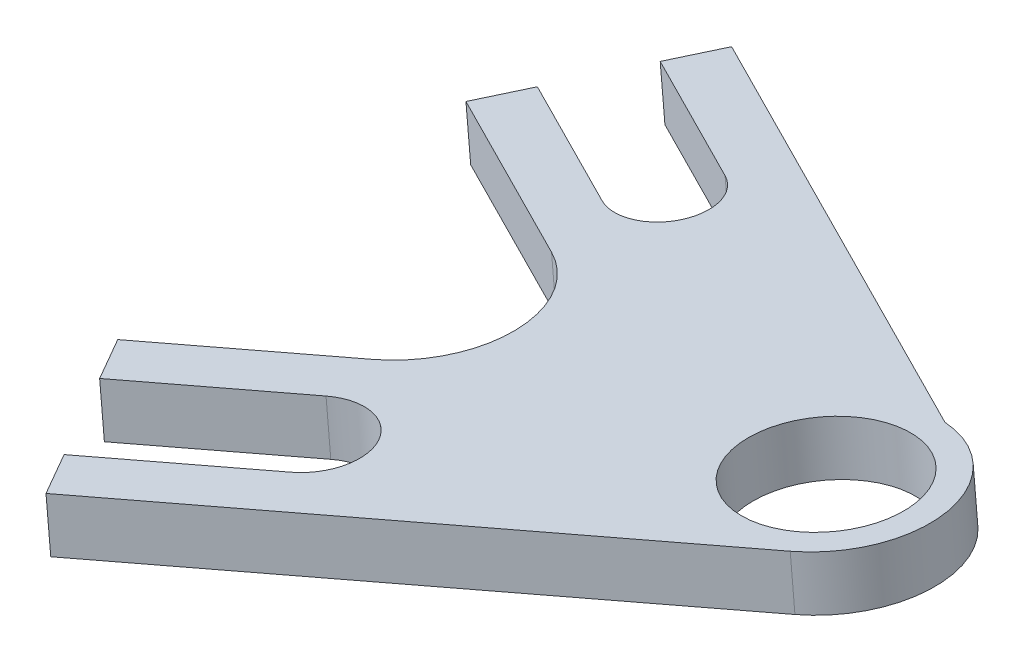
ISO-10303-21;
HEADER;
FILE_DESCRIPTION(('STEP AP214'),'2;1');
FILE_NAME('part.step','',(''),(''),'','','');
FILE_SCHEMA(('AUTOMOTIVE_DESIGN { 1 0 10303 214 1 1 1 1 }'));
ENDSEC;
DATA;
#1=APPLICATION_CONTEXT('core data for automotive mechanical design processes');
#2=APPLICATION_PROTOCOL_DEFINITION('international standard','automotive_design',2000,#1);
#3=PRODUCT_CONTEXT('',#1,'mechanical');
#4=PRODUCT('Part','Part','',(#3));
#5=PRODUCT_RELATED_PRODUCT_CATEGORY('part','',(#4));
#6=PRODUCT_DEFINITION_FORMATION('','',#4);
#7=PRODUCT_DEFINITION_CONTEXT('part definition',#1,'design');
#8=PRODUCT_DEFINITION('design','',#6,#7);
#9=PRODUCT_DEFINITION_SHAPE('','',#8);
#10=(LENGTH_UNIT() NAMED_UNIT(*) SI_UNIT(.MILLI.,.METRE.));
#11=(NAMED_UNIT(*) PLANE_ANGLE_UNIT() SI_UNIT($,.RADIAN.));
#12=(NAMED_UNIT(*) SI_UNIT($,.STERADIAN.) SOLID_ANGLE_UNIT());
#13=UNCERTAINTY_MEASURE_WITH_UNIT(LENGTH_MEASURE(1.E-05),#10,'distance_accuracy_value','');
#14=(GEOMETRIC_REPRESENTATION_CONTEXT(3) GLOBAL_UNCERTAINTY_ASSIGNED_CONTEXT((#13)) GLOBAL_UNIT_ASSIGNED_CONTEXT((#10,
#11,#12)) REPRESENTATION_CONTEXT('',''));
#15=CARTESIAN_POINT('',(0.,0.,0.));
#16=DIRECTION('',(0.,0.,1.));
#17=DIRECTION('',(1.,0.,0.));
#18=AXIS2_PLACEMENT_3D('',#15,#16,#17);
#19=CARTESIAN_POINT('',(55.2371868692463,626.955449979059,-203.195316494935));
#20=DIRECTION('',(0.478972108807124,0.0432976141831221,-0.876761675480233));
#21=DIRECTION('',(-0.877584658061745,0.,-0.479421701568306));
#22=AXIS2_PLACEMENT_3D('',#19,#20,#21);
#23=PLANE('',#22);
#24=DIRECTION('',(0.873201205734836,0.078934719193365,0.4809251130988));
#25=VECTOR('',#24,1.);
#26=CARTESIAN_POINT('',(55.8088763954831,620.631236898715,-203.195316494935));
#27=LINE('',#26,#25);
#28=CARTESIAN_POINT('',(468.465882847298,657.934168586764,24.0800424892996));
#29=VERTEX_POINT('',#28);
#30=CARTESIAN_POINT('',(491.434349147078,660.010447714379,36.7301764794741));
#31=VERTEX_POINT('',#30);
#32=EDGE_CURVE('E232',#29,#31,#27,.T.);
#33=ORIENTED_EDGE('',*,*,#32,.T.);
#34=DIRECTION('',(0.0900298466514624,-0.995939067770672,0.));
#35=VECTOR('',#34,1.);
#36=CARTESIAN_POINT('',(490.862659620841,666.334660794722,36.7301764794741));
#37=LINE('',#36,#35);
#38=CARTESIAN_POINT('',(490.862659620841,666.334660794722,36.7301764794741));
#39=VERTEX_POINT('',#38);
#40=EDGE_CURVE('E57',#31,#39,#37,.F.);
#41=ORIENTED_EDGE('',*,*,#40,.T.);
#42=DIRECTION('',(0.873201205734836,0.078934719193365,0.4809251130988));
#43=VECTOR('',#42,1.);
#44=CARTESIAN_POINT('',(55.2371868692463,626.955449979059,-203.195316494935));
#45=LINE('',#44,#43);
#46=CARTESIAN_POINT('',(467.894193321061,664.258381667108,24.0800424892996));
#47=VERTEX_POINT('',#46);
#48=EDGE_CURVE('E166',#47,#39,#45,.T.);
#49=ORIENTED_EDGE('',*,*,#48,.F.);
#50=DIRECTION('',(0.0900298466514623,-0.995939067770671,0.));
#51=VECTOR('',#50,1.);
#52=CARTESIAN_POINT('',(467.894193321061,664.258381667108,24.0800424892996));
#53=LINE('',#52,#51);
#54=EDGE_CURVE('E231',#47,#29,#53,.T.);
#55=ORIENTED_EDGE('',*,*,#54,.T.);
#56=EDGE_LOOP('',(#33,#41,#49,#55));
#57=FACE_BOUND('',#56,.T.);
#58=ADVANCED_FACE('F41',(#57),#23,.F.);
#59=CARTESIAN_POINT('',(115.266803288953,632.381943763372,285.699826684711));
#60=DIRECTION('',(0.513091827516233,0.0463819324336835,0.85707963041935));
#61=DIRECTION('',(0.858003031260112,0.,-0.513644622621963));
#62=AXIS2_PLACEMENT_3D('',#59,#60,#61);
#63=PLANE('',#62);
#64=DIRECTION('',(-0.853599088125079,-0.0771627476947464,0.51518395464167));
#65=VECTOR('',#64,1.);
#66=CARTESIAN_POINT('',(115.266803288953,632.381943763372,285.699826684711));
#67=LINE('',#66,#65);
#68=CARTESIAN_POINT('',(491.295980048447,666.373831636505,58.7499610643986));
#69=VERTEX_POINT('',#68);
#70=CARTESIAN_POINT('',(472.148895715178,664.64299375482,70.3060542747813));
#71=VERTEX_POINT('',#70);
#72=EDGE_CURVE('E154',#69,#71,#67,.T.);
#73=ORIENTED_EDGE('',*,*,#72,.F.);
#74=DIRECTION('',(0.0900298466514623,-0.995939067770672,0.));
#75=VECTOR('',#74,1.);
#76=CARTESIAN_POINT('',(491.867669574683,660.049618556161,58.7499610643987));
#77=LINE('',#76,#75);
#78=CARTESIAN_POINT('',(491.867669574683,660.049618556161,58.7499610643987));
#79=VERTEX_POINT('',#78);
#80=EDGE_CURVE('E175',#69,#79,#77,.T.);
#81=ORIENTED_EDGE('',*,*,#80,.T.);
#82=DIRECTION('',(-0.853599088125079,-0.0771627476947464,0.51518395464167));
#83=VECTOR('',#82,1.);
#84=CARTESIAN_POINT('',(115.838492815189,626.057730683028,285.699826684711));
#85=LINE('',#84,#83);
#86=CARTESIAN_POINT('',(472.720585241414,658.318780674476,70.3060542747813));
#87=VERTEX_POINT('',#86);
#88=EDGE_CURVE('E171',#79,#87,#85,.T.);
#89=ORIENTED_EDGE('',*,*,#88,.T.);
#90=DIRECTION('',(0.0900298466514623,-0.995939067770671,0.));
#91=VECTOR('',#90,1.);
#92=CARTESIAN_POINT('',(472.148895715178,664.64299375482,70.3060542747813));
#93=LINE('',#92,#91);
#94=EDGE_CURVE('E169',#71,#87,#93,.T.);
#95=ORIENTED_EDGE('',*,*,#94,.F.);
#96=EDGE_LOOP('',(#73,#81,#89,#95));
#97=FACE_BOUND('',#96,.T.);
#98=ADVANCED_FACE('F170',(#97),#63,.F.);
#99=CARTESIAN_POINT('',(301.11432553989,649.18199154768,-215.393772409947));
#100=DIRECTION('',(0.853599088125032,0.0771627476947419,-0.515183954641748));
#101=DIRECTION('',(-0.516724563479205,0.,-0.856151695377183));
#102=AXIS2_PLACEMENT_3D('',#99,#100,#101);
#103=PLANE('',#102);
#104=DIRECTION('',(0.513091827516311,0.0463819324336908,0.857079630419303));
#105=VECTOR('',#104,1.);
#106=CARTESIAN_POINT('',(301.686015066126,642.857778467336,-215.393772409947));
#107=LINE('',#106,#105);
#108=CARTESIAN_POINT('',(475.978718346143,658.61330594543,75.7485099279438));
#109=VERTEX_POINT('',#108);
#110=EDGE_CURVE('E237',#87,#109,#107,.T.);
#111=ORIENTED_EDGE('',*,*,#110,.T.);
#112=DIRECTION('',(0.0900298466514623,-0.995939067770671,0.));
#113=VECTOR('',#112,1.);
#114=CARTESIAN_POINT('',(475.407028819906,664.937519025774,75.7485099279438));
#115=LINE('',#114,#113);
#116=CARTESIAN_POINT('',(475.407028819906,664.937519025774,75.7485099279438));
#117=VERTEX_POINT('',#116);
#118=EDGE_CURVE('E176',#117,#109,#115,.T.);
#119=ORIENTED_EDGE('',*,*,#118,.F.);
#120=DIRECTION('',(0.513091827516311,0.0463819324336908,0.857079630419303));
#121=VECTOR('',#120,1.);
#122=CARTESIAN_POINT('',(301.11432553989,649.18199154768,-215.393772409947));
#123=LINE('',#122,#121);
#124=EDGE_CURVE('E159',#71,#117,#123,.T.);
#125=ORIENTED_EDGE('',*,*,#124,.F.);
#126=ORIENTED_EDGE('',*,*,#94,.T.);
#127=EDGE_LOOP('',(#111,#119,#125,#126));
#128=FACE_BOUND('',#127,.T.);
#129=ADVANCED_FACE('F178',(#128),#103,.F.);
#130=CARTESIAN_POINT('',(118.52493639368,632.676469034326,291.142282337874));
#131=DIRECTION('',(-0.513091827516232,-0.0463819324336834,-0.85707963041935));
#132=DIRECTION('',(-0.858003031260113,0.,0.513644622621962));
#133=AXIS2_PLACEMENT_3D('',#130,#131,#132);
#134=PLANE('',#133);
#135=DIRECTION('',(0.853599088125079,0.0771627476947464,-0.51518395464167));
#136=VECTOR('',#135,1.);
#137=CARTESIAN_POINT('',(119.096625919917,626.352255953982,291.142282337874));
#138=LINE('',#137,#136);
#139=CARTESIAN_POINT('',(492.998630564269,660.151853971716,65.4762570563434));
#140=VERTEX_POINT('',#139);
#141=EDGE_CURVE('E240',#109,#140,#138,.T.);
#142=ORIENTED_EDGE('',*,*,#141,.T.);
#143=DIRECTION('',(0.0900298466514623,-0.995939067770671,0.));
#144=VECTOR('',#143,1.);
#145=CARTESIAN_POINT('',(492.426941038033,666.47606705206,65.4762570563434));
#146=LINE('',#145,#144);
#147=CARTESIAN_POINT('',(492.426941038033,666.47606705206,65.4762570563434));
#148=VERTEX_POINT('',#147);
#149=EDGE_CURVE('E323',#148,#140,#146,.T.);
#150=ORIENTED_EDGE('',*,*,#149,.F.);
#151=DIRECTION('',(0.853599088125079,0.0771627476947464,-0.51518395464167));
#152=VECTOR('',#151,1.);
#153=CARTESIAN_POINT('',(118.52493639368,632.676469034326,291.142282337874));
#154=LINE('',#153,#152);
#155=EDGE_CURVE('E182',#117,#148,#154,.T.);
#156=ORIENTED_EDGE('',*,*,#155,.F.);
#157=ORIENTED_EDGE('',*,*,#118,.T.);
#158=EDGE_LOOP('',(#142,#150,#156,#157));
#159=FACE_BOUND('',#158,.T.);
#160=ADVANCED_FACE('F339',(#159),#134,.F.);
#161=CARTESIAN_POINT('',(495.619911480666,666.764701817595,70.809863596443));
#162=DIRECTION('',(0.0900298466514623,-0.995939067770671,0.));
#163=DIRECTION('',(0.995939067770672,0.0900298466514623,0.));
#164=AXIS2_PLACEMENT_3D('',#161,#162,#163);
#165=CYLINDRICAL_SURFACE('',#164,6.22299999999999);
#166=CARTESIAN_POINT('',(496.191601006903,660.440488737251,70.809863596443));
#167=DIRECTION('',(-0.0900298466514627,0.995939067770672,0.));
#168=DIRECTION('',(-0.995939067770672,-0.0900298466514627,0.));
#169=AXIS2_PLACEMENT_3D('',#166,#167,#168);
#170=CIRCLE('',#169,6.22299999999999);
#171=CARTESIAN_POINT('',(499.384571449536,660.729123502786,76.143470136543));
#172=VERTEX_POINT('',#171);
#173=EDGE_CURVE('E243',#140,#172,#170,.F.);
#174=ORIENTED_EDGE('',*,*,#173,.T.);
#175=DIRECTION('',(0.0900298466514623,-0.995939067770671,0.));
#176=VECTOR('',#175,1.);
#177=CARTESIAN_POINT('',(498.812881923299,667.053336583129,76.143470136543));
#178=LINE('',#177,#176);
#179=CARTESIAN_POINT('',(498.812881923299,667.053336583129,76.143470136543));
#180=VERTEX_POINT('',#179);
#181=EDGE_CURVE('E320',#180,#172,#178,.T.);
#182=ORIENTED_EDGE('',*,*,#181,.F.);
#183=CARTESIAN_POINT('',(495.619911480666,666.764701817595,70.809863596443));
#184=DIRECTION('',(-0.0900298466514627,0.995939067770672,0.));
#185=DIRECTION('',(-0.995939067770672,-0.0900298466514627,0.));
#186=AXIS2_PLACEMENT_3D('',#183,#184,#185);
#187=CIRCLE('',#186,6.22299999999999);
#188=EDGE_CURVE('E185',#148,#180,#187,.F.);
#189=ORIENTED_EDGE('',*,*,#188,.F.);
#190=ORIENTED_EDGE('',*,*,#149,.T.);
#191=EDGE_LOOP('',(#174,#182,#189,#190));
#192=FACE_BOUND('',#191,.T.);
#193=ADVANCED_FACE('F346',(#192),#165,.F.);
#194=CARTESIAN_POINT('',(124.910877278949,633.253738565395,301.809495418073));
#195=DIRECTION('',(-0.513091827516235,-0.0463819324336837,-0.857079630419349));
#196=DIRECTION('',(-0.858003031260111,0.,0.513644622621965));
#197=AXIS2_PLACEMENT_3D('',#194,#195,#196);
#198=PLANE('',#197);
#199=DIRECTION('',(0.853599088125078,0.0771627476947463,-0.515183954641672));
#200=VECTOR('',#199,1.);
#201=CARTESIAN_POINT('',(125.482566805186,626.929525485052,301.809495418073));
#202=LINE('',#201,#200);
#203=CARTESIAN_POINT('',(482.36465923141,659.1905754765,86.4157230081433));
#204=VERTEX_POINT('',#203);
#205=EDGE_CURVE('E247',#204,#172,#202,.T.);
#206=ORIENTED_EDGE('',*,*,#205,.F.);
#207=DIRECTION('',(0.0900298466514623,-0.995939067770671,0.));
#208=VECTOR('',#207,1.);
#209=CARTESIAN_POINT('',(481.792969705173,665.514788556844,86.4157230081433));
#210=LINE('',#209,#208);
#211=CARTESIAN_POINT('',(481.792969705173,665.514788556844,86.4157230081433));
#212=VERTEX_POINT('',#211);
#213=EDGE_CURVE('E317',#212,#204,#210,.T.);
#214=ORIENTED_EDGE('',*,*,#213,.F.);
#215=DIRECTION('',(0.853599088125078,0.0771627476947463,-0.515183954641672));
#216=VECTOR('',#215,1.);
#217=CARTESIAN_POINT('',(124.910877278949,633.253738565395,301.809495418073));
#218=LINE('',#217,#216);
#219=EDGE_CURVE('E191',#212,#180,#218,.T.);
#220=ORIENTED_EDGE('',*,*,#219,.T.);
#221=ORIENTED_EDGE('',*,*,#181,.T.);
#222=EDGE_LOOP('',(#206,#214,#220,#221));
#223=FACE_BOUND('',#222,.T.);
#224=ADVANCED_FACE('F349',(#223),#198,.T.);
#225=CARTESIAN_POINT('',(301.11432553994,649.181991547684,-215.393772409928));
#226=DIRECTION('',(-0.853599088125084,-0.0771627476947465,0.515183954641662));
#227=DIRECTION('',(0.516724563479119,0.,0.856151695377235));
#228=AXIS2_PLACEMENT_3D('',#225,#226,#227);
#229=PLANE('',#228);
#230=DIRECTION('',(-0.513091827516225,-0.046381932433683,-0.857079630419355));
#231=VECTOR('',#230,1.);
#232=CARTESIAN_POINT('',(301.686015066177,642.85777846734,-215.393772409928));
#233=LINE('',#232,#231);
#234=CARTESIAN_POINT('',(485.622792336138,659.485100747454,91.8581786613062));
#235=VERTEX_POINT('',#234);
#236=EDGE_CURVE('E251',#235,#204,#233,.T.);
#237=ORIENTED_EDGE('',*,*,#236,.F.);
#238=DIRECTION('',(0.0900298466514623,-0.995939067770671,0.));
#239=VECTOR('',#238,1.);
#240=CARTESIAN_POINT('',(485.051102809901,665.809313827798,91.8581786613062));
#241=LINE('',#240,#239);
#242=CARTESIAN_POINT('',(485.051102809901,665.809313827798,91.8581786613062));
#243=VERTEX_POINT('',#242);
#244=EDGE_CURVE('E314',#243,#235,#241,.T.);
#245=ORIENTED_EDGE('',*,*,#244,.F.);
#246=DIRECTION('',(-0.513091827516225,-0.046381932433683,-0.857079630419355));
#247=VECTOR('',#246,1.);
#248=CARTESIAN_POINT('',(301.11432553994,649.181991547684,-215.393772409928));
#249=LINE('',#248,#247);
#250=EDGE_CURVE('E195',#243,#212,#249,.T.);
#251=ORIENTED_EDGE('',*,*,#250,.T.);
#252=ORIENTED_EDGE('',*,*,#213,.T.);
#253=EDGE_LOOP('',(#237,#245,#251,#252));
#254=FACE_BOUND('',#253,.T.);
#255=ADVANCED_FACE('F352',(#254),#229,.T.);
#256=CARTESIAN_POINT('',(128.169010383677,633.548263836349,307.251951071236));
#257=DIRECTION('',(0.513091827516235,0.0463819324336836,0.857079630419349));
#258=DIRECTION('',(0.858003031260111,0.,-0.513644622621965));
#259=AXIS2_PLACEMENT_3D('',#256,#257,#258);
#260=PLANE('',#259);
#261=DIRECTION('',(-0.853599088125078,-0.0771627476947463,0.515183954641672));
#262=VECTOR('',#261,1.);
#263=CARTESIAN_POINT('',(128.740699909914,627.224050756006,307.251951071236));
#264=LINE('',#263,#262);
#265=CARTESIAN_POINT('',(541.567230192359,664.542306880026,58.0932916834163));
#266=VERTEX_POINT('',#265);
#267=EDGE_CURVE('E255',#266,#235,#264,.T.);
#268=ORIENTED_EDGE('',*,*,#267,.F.);
#269=DIRECTION('',(0.0900298466514623,-0.995939067770671,0.));
#270=VECTOR('',#269,1.);
#271=CARTESIAN_POINT('',(540.995540666122,670.86651996037,58.0932916834163));
#272=LINE('',#271,#270);
#273=CARTESIAN_POINT('',(540.995540666122,670.86651996037,58.0932916834163));
#274=VERTEX_POINT('',#273);
#275=EDGE_CURVE('E311',#274,#266,#272,.T.);
#276=ORIENTED_EDGE('',*,*,#275,.F.);
#277=DIRECTION('',(-0.853599088125078,-0.0771627476947463,0.515183954641672));
#278=VECTOR('',#277,1.);
#279=CARTESIAN_POINT('',(128.169010383677,633.548263836349,307.251951071236));
#280=LINE('',#279,#278);
#281=EDGE_CURVE('E199',#274,#243,#280,.T.);
#282=ORIENTED_EDGE('',*,*,#281,.T.);
#283=ORIENTED_EDGE('',*,*,#244,.T.);
#284=EDGE_LOOP('',(#268,#276,#282,#283));
#285=FACE_BOUND('',#284,.T.);
#286=ADVANCED_FACE('F356',(#285),#260,.T.);
#287=CARTESIAN_POINT('',(534.544437118761,670.283359923881,47.3172294901537));
#288=DIRECTION('',(0.0900298466514623,-0.995939067770671,0.));
#289=DIRECTION('',(0.995939067770672,0.0900298466514623,0.));
#290=AXIS2_PLACEMENT_3D('',#287,#288,#289);
#291=CYLINDRICAL_SURFACE('',#290,12.5730000000001);
#292=CARTESIAN_POINT('',(535.116126644997,663.959146843537,47.3172294901537));
#293=DIRECTION('',(-0.0900298466514627,0.995939067770672,0.));
#294=DIRECTION('',(-0.995939067770672,-0.0900298466514627,0.));
#295=AXIS2_PLACEMENT_3D('',#292,#293,#294);
#296=CIRCLE('',#295,12.5730000000001);
#297=CARTESIAN_POINT('',(537.00931239521,664.130285046958,34.8887586095296));
#298=VERTEX_POINT('',#297);
#299=EDGE_CURVE('E259',#266,#298,#296,.T.);
#300=ORIENTED_EDGE('',*,*,#299,.T.);
#301=DIRECTION('',(0.0900298466514623,-0.995939067770671,0.));
#302=VECTOR('',#301,1.);
#303=CARTESIAN_POINT('',(536.437622868973,670.454498127301,34.8887586095296));
#304=LINE('',#303,#302);
#305=CARTESIAN_POINT('',(536.437622868973,670.454498127301,34.8887586095296));
#306=VERTEX_POINT('',#305);
#307=EDGE_CURVE('E308',#306,#298,#304,.T.);
#308=ORIENTED_EDGE('',*,*,#307,.F.);
#309=CARTESIAN_POINT('',(534.544437118761,670.283359923881,47.3172294901537));
#310=DIRECTION('',(-0.0900298466514627,0.995939067770672,0.));
#311=DIRECTION('',(-0.995939067770672,-0.0900298466514627,0.));
#312=AXIS2_PLACEMENT_3D('',#309,#310,#311);
#313=CIRCLE('',#312,12.5730000000001);
#314=EDGE_CURVE('E203',#274,#306,#313,.T.);
#315=ORIENTED_EDGE('',*,*,#314,.F.);
#316=ORIENTED_EDGE('',*,*,#275,.T.);
#317=EDGE_LOOP('',(#300,#308,#315,#316));
#318=FACE_BOUND('',#317,.T.);
#319=ADVANCED_FACE('F361',(#318),#291,.T.);
#320=CARTESIAN_POINT('',(66.5514660234887,627.978226221292,-223.906180793129));
#321=DIRECTION('',(0.478972108807125,0.0432976141831222,-0.876761675480233));
#322=DIRECTION('',(-0.877584658061745,0.,-0.479421701568307));
#323=AXIS2_PLACEMENT_3D('',#320,#321,#322);
#324=PLANE('',#323);
#325=DIRECTION('',(0.873201205734835,0.0789347191933649,0.480925113098801));
#326=VECTOR('',#325,1.);
#327=CARTESIAN_POINT('',(67.1231555497255,621.654013140948,-223.906180793129));
#328=LINE('',#327,#326);
#329=CARTESIAN_POINT('',(479.78016200154,658.956944828998,3.36917819110558));
#330=VERTEX_POINT('',#329);
#331=EDGE_CURVE('E263',#330,#298,#328,.T.);
#332=ORIENTED_EDGE('',*,*,#331,.F.);
#333=DIRECTION('',(0.0900298466514623,-0.995939067770671,0.));
#334=VECTOR('',#333,1.);
#335=CARTESIAN_POINT('',(479.208472475303,665.281157909341,3.36917819110558));
#336=LINE('',#335,#334);
#337=CARTESIAN_POINT('',(479.208472475303,665.281157909341,3.36917819110558));
#338=VERTEX_POINT('',#337);
#339=EDGE_CURVE('E305',#338,#330,#336,.T.);
#340=ORIENTED_EDGE('',*,*,#339,.F.);
#341=DIRECTION('',(0.873201205734835,0.0789347191933649,0.480925113098801));
#342=VECTOR('',#341,1.);
#343=CARTESIAN_POINT('',(66.5514660234887,627.978226221292,-223.906180793129));
#344=LINE('',#343,#342);
#345=EDGE_CURVE('E206',#338,#306,#344,.T.);
#346=ORIENTED_EDGE('',*,*,#345,.T.);
#347=ORIENTED_EDGE('',*,*,#307,.T.);
#348=EDGE_LOOP('',(#332,#340,#346,#347));
#349=FACE_BOUND('',#348,.T.);
#350=ADVANCED_FACE('F367',(#349),#324,.T.);
#351=CARTESIAN_POINT('',(356.889239565529,654.223873244285,227.275358984232));
#352=DIRECTION('',(0.87320120573484,0.078934719193365,0.480925113098792));
#353=DIRECTION('',(0.482430398608977,0.,-0.875934307181756));
#354=AXIS2_PLACEMENT_3D('',#351,#352,#353);
#355=PLANE('',#354);
#356=DIRECTION('',(-0.478972108807116,-0.0432976141831216,0.876761675480238));
#357=VECTOR('',#356,1.);
#358=CARTESIAN_POINT('',(357.460929091765,647.899660163941,227.275358984232));
#359=LINE('',#358,#357);
#360=CARTESIAN_POINT('',(476.738689110614,658.682004978935,8.93661483040506));
#361=VERTEX_POINT('',#360);
#362=EDGE_CURVE('E267',#330,#361,#359,.T.);
#363=ORIENTED_EDGE('',*,*,#362,.T.);
#364=DIRECTION('',(0.0900298466514623,-0.995939067770671,0.));
#365=VECTOR('',#364,1.);
#366=CARTESIAN_POINT('',(476.166999584378,665.006218059278,8.93661483040506));
#367=LINE('',#366,#365);
#368=CARTESIAN_POINT('',(476.166999584378,665.006218059278,8.93661483040506));
#369=VERTEX_POINT('',#368);
#370=EDGE_CURVE('E301',#369,#361,#367,.T.);
#371=ORIENTED_EDGE('',*,*,#370,.F.);
#372=DIRECTION('',(-0.478972108807116,-0.0432976141831216,0.876761675480238));
#373=VECTOR('',#372,1.);
#374=CARTESIAN_POINT('',(356.889239565529,654.223873244285,227.275358984232));
#375=LINE('',#374,#373);
#376=EDGE_CURVE('E210',#338,#369,#375,.T.);
#377=ORIENTED_EDGE('',*,*,#376,.F.);
#378=ORIENTED_EDGE('',*,*,#339,.T.);
#379=EDGE_LOOP('',(#363,#371,#377,#378));
#380=FACE_BOUND('',#379,.T.);
#381=ADVANCED_FACE('F370',(#380),#355,.F.);
#382=CARTESIAN_POINT('',(63.5099931325632,627.70328637123,-218.33874415383));
#383=DIRECTION('',(0.478972108807124,0.0432976141831222,-0.876761675480233));
#384=DIRECTION('',(-0.877584658061745,0.,-0.479421701568307));
#385=AXIS2_PLACEMENT_3D('',#382,#383,#384);
#386=PLANE('',#385);
#387=DIRECTION('',(0.873201205734836,0.078934719193365,0.480925113098801));
#388=VECTOR('',#387,1.);
#389=CARTESIAN_POINT('',(64.0816826588,621.379073290886,-218.33874415383));
#390=LINE('',#389,#388);
#391=CARTESIAN_POINT('',(494.149447951761,660.255884344931,18.525780660482));
#392=VERTEX_POINT('',#391);
#393=EDGE_CURVE('E270',#361,#392,#390,.T.);
#394=ORIENTED_EDGE('',*,*,#393,.T.);
#395=DIRECTION('',(0.0900298466514623,-0.995939067770671,0.));
#396=VECTOR('',#395,1.);
#397=CARTESIAN_POINT('',(493.577758425525,666.580097425275,18.525780660482));
#398=LINE('',#397,#396);
#399=CARTESIAN_POINT('',(493.577758425525,666.580097425275,18.525780660482));
#400=VERTEX_POINT('',#399);
#401=EDGE_CURVE('E297',#400,#392,#398,.T.);
#402=ORIENTED_EDGE('',*,*,#401,.F.);
#403=DIRECTION('',(0.873201205734836,0.078934719193365,0.480925113098801));
#404=VECTOR('',#403,1.);
#405=CARTESIAN_POINT('',(63.5099931325632,627.70328637123,-218.33874415383));
#406=LINE('',#405,#404);
#407=EDGE_CURVE('E213',#369,#400,#406,.T.);
#408=ORIENTED_EDGE('',*,*,#407,.F.);
#409=ORIENTED_EDGE('',*,*,#370,.T.);
#410=EDGE_LOOP('',(#394,#402,#408,#409));
#411=FACE_BOUND('',#410,.T.);
#412=ADVANCED_FACE('F375',(#411),#386,.F.);
#413=CARTESIAN_POINT('',(490.962091739329,666.343649154221,23.3137761702796));
#414=DIRECTION('',(0.0900298466514623,-0.995939067770671,0.));
#415=DIRECTION('',(0.995939067770672,0.0900298466514623,0.));
#416=AXIS2_PLACEMENT_3D('',#413,#414,#415);
#417=CYLINDRICAL_SURFACE('',#416,5.46099999999999);
#418=CARTESIAN_POINT('',(491.533781265566,660.019436073877,23.3137761702796));
#419=DIRECTION('',(-0.0900298466514627,0.995939067770672,0.));
#420=DIRECTION('',(-0.995939067770672,-0.0900298466514627,0.));
#421=AXIS2_PLACEMENT_3D('',#418,#419,#420);
#422=CIRCLE('',#421,5.46099999999999);
#423=CARTESIAN_POINT('',(488.91811457937,659.782987802823,28.1017716800771));
#424=VERTEX_POINT('',#423);
#425=EDGE_CURVE('E273',#392,#424,#422,.F.);
#426=ORIENTED_EDGE('',*,*,#425,.T.);
#427=DIRECTION('',(0.0900298466514623,-0.995939067770671,0.));
#428=VECTOR('',#427,1.);
#429=CARTESIAN_POINT('',(488.346425053133,666.107200883167,28.1017716800771));
#430=LINE('',#429,#428);
#431=CARTESIAN_POINT('',(488.346425053133,666.107200883167,28.1017716800771));
#432=VERTEX_POINT('',#431);
#433=EDGE_CURVE('E294',#432,#424,#430,.T.);
#434=ORIENTED_EDGE('',*,*,#433,.F.);
#435=CARTESIAN_POINT('',(490.962091739329,666.343649154221,23.3137761702796));
#436=DIRECTION('',(-0.0900298466514627,0.995939067770672,0.));
#437=DIRECTION('',(-0.995939067770672,-0.0900298466514627,0.));
#438=AXIS2_PLACEMENT_3D('',#435,#436,#437);
#439=CIRCLE('',#438,5.46099999999999);
#440=EDGE_CURVE('E216',#400,#432,#439,.F.);
#441=ORIENTED_EDGE('',*,*,#440,.F.);
#442=ORIENTED_EDGE('',*,*,#401,.T.);
#443=EDGE_LOOP('',(#426,#434,#441,#442));
#444=FACE_BOUND('',#443,.T.);
#445=ADVANCED_FACE('F381',(#444),#417,.F.);
#446=CARTESIAN_POINT('',(58.2786597601699,627.230389829121,-208.762753134233));
#447=DIRECTION('',(0.47897210880712,0.0432976141831218,-0.876761675480235));
#448=DIRECTION('',(-0.877584658061747,0.,-0.479421701568303));
#449=AXIS2_PLACEMENT_3D('',#446,#447,#448);
#450=PLANE('',#449);
#451=DIRECTION('',(0.873201205734838,0.0789347191933651,0.480925113098797));
#452=VECTOR('',#451,1.);
#453=CARTESIAN_POINT('',(58.8503492864067,620.906176748778,-208.762753134233));
#454=LINE('',#453,#452);
#455=CARTESIAN_POINT('',(471.507355738223,658.209108436827,18.5126058500002));
#456=VERTEX_POINT('',#455);
#457=EDGE_CURVE('E277',#456,#424,#454,.T.);
#458=ORIENTED_EDGE('',*,*,#457,.F.);
#459=DIRECTION('',(0.0900298466514623,-0.995939067770671,0.));
#460=VECTOR('',#459,1.);
#461=CARTESIAN_POINT('',(470.935666211986,664.533321517171,18.5126058500002));
#462=LINE('',#461,#460);
#463=CARTESIAN_POINT('',(470.935666211986,664.533321517171,18.5126058500002));
#464=VERTEX_POINT('',#463);
#465=EDGE_CURVE('E291',#464,#456,#462,.T.);
#466=ORIENTED_EDGE('',*,*,#465,.F.);
#467=DIRECTION('',(0.873201205734838,0.0789347191933651,0.480925113098797));
#468=VECTOR('',#467,1.);
#469=CARTESIAN_POINT('',(58.2786597601699,627.230389829121,-208.762753134233));
#470=LINE('',#469,#468);
#471=EDGE_CURVE('E219',#464,#432,#470,.T.);
#472=ORIENTED_EDGE('',*,*,#471,.T.);
#473=ORIENTED_EDGE('',*,*,#433,.T.);
#474=EDGE_LOOP('',(#458,#466,#472,#473));
#475=FACE_BOUND('',#474,.T.);
#476=ADVANCED_FACE('F385',(#475),#450,.T.);
#477=CARTESIAN_POINT('',(356.88923956552,654.223873244284,227.275358984238));
#478=DIRECTION('',(-0.873201205734831,-0.0789347191933642,-0.480925113098809));
#479=DIRECTION('',(-0.482430398608994,0.,0.875934307181747));
#480=AXIS2_PLACEMENT_3D('',#477,#478,#479);
#481=PLANE('',#480);
#482=DIRECTION('',(0.478972108807132,0.0432976141831231,-0.876761675480229));
#483=VECTOR('',#482,1.);
#484=CARTESIAN_POINT('',(357.460929091757,647.89966016394,227.275358984238));
#485=LINE('',#484,#483);
#486=EDGE_CURVE('E281',#29,#456,#485,.T.);
#487=ORIENTED_EDGE('',*,*,#486,.F.);
#488=ORIENTED_EDGE('',*,*,#54,.F.);
#489=DIRECTION('',(0.478972108807132,0.0432976141831231,-0.876761675480229));
#490=VECTOR('',#489,1.);
#491=CARTESIAN_POINT('',(356.88923956552,654.223873244284,227.275358984238));
#492=LINE('',#491,#490);
#493=EDGE_CURVE('E223',#47,#464,#492,.T.);
#494=ORIENTED_EDGE('',*,*,#493,.T.);
#495=ORIENTED_EDGE('',*,*,#465,.T.);
#496=EDGE_LOOP('',(#487,#488,#494,#495));
#497=FACE_BOUND('',#496,.T.);
#498=ADVANCED_FACE('F388',(#497),#481,.T.);
#499=CARTESIAN_POINT('',(534.544437118761,670.283359923881,47.3172294901537));
#500=DIRECTION('',(0.0900298466514623,-0.995939067770671,0.));
#501=DIRECTION('',(0.995939067770672,0.0900298466514623,0.));
#502=AXIS2_PLACEMENT_3D('',#499,#500,#501);
#503=CYLINDRICAL_SURFACE('',#502,9.39800000000005);
#504=CARTESIAN_POINT('',(534.544437118761,670.283359923881,47.3172294901537));
#505=DIRECTION('',(-0.0900298466514627,0.995939067770672,0.));
#506=DIRECTION('',(-0.995939067770672,-0.0900298466514627,0.));
#507=AXIS2_PLACEMENT_3D('',#504,#505,#506);
#508=CIRCLE('',#507,9.39800000000005);
#509=CARTESIAN_POINT('',(525.184601759852,669.43725942505,47.3172294901537));
#510=VERTEX_POINT('',#509);
#511=EDGE_CURVE('E227',#510,#510,#508,.T.);
#512=ORIENTED_EDGE('',*,*,#511,.T.);
#513=EDGE_LOOP('',(#512));
#514=FACE_BOUND('',#513,.T.);
#515=CARTESIAN_POINT('',(535.116126644997,663.959146843537,47.3172294901537));
#516=DIRECTION('',(-0.0900298466514627,0.995939067770672,0.));
#517=DIRECTION('',(-0.995939067770672,-0.0900298466514627,0.));
#518=AXIS2_PLACEMENT_3D('',#515,#516,#517);
#519=CIRCLE('',#518,9.39800000000005);
#520=CARTESIAN_POINT('',(525.756291286089,663.113046344707,47.3172294901537));
#521=VERTEX_POINT('',#520);
#522=EDGE_CURVE('E285',#521,#521,#519,.T.);
#523=ORIENTED_EDGE('',*,*,#522,.F.);
#524=EDGE_LOOP('',(#523));
#525=FACE_BOUND('',#524,.T.);
#526=ADVANCED_FACE('F427',(#514,#525),#503,.F.);
#527=CARTESIAN_POINT('',(-55.7677668862901,616.920941556235,0.));
#528=DIRECTION('',(-0.0900298466514627,0.995939067770672,0.));
#529=DIRECTION('',(-0.995939067770672,-0.0900298466514627,0.));
#530=AXIS2_PLACEMENT_3D('',#527,#528,#529);
#531=PLANE('',#530);
#532=ORIENTED_EDGE('',*,*,#48,.T.);
#533=CARTESIAN_POINT('',(484.77971383899,665.784781094597,47.865049758073));
#534=DIRECTION('',(-0.0900298466514627,0.995939067770672,0.));
#535=DIRECTION('',(-0.995939067770672,-0.0900298466514627,0.));
#536=AXIS2_PLACEMENT_3D('',#533,#534,#535);
#537=CIRCLE('',#536,12.7);
#538=EDGE_CURVE('E11',#39,#69,#537,.F.);
#539=ORIENTED_EDGE('',*,*,#538,.T.);
#540=ORIENTED_EDGE('',*,*,#72,.T.);
#541=ORIENTED_EDGE('',*,*,#124,.T.);
#542=ORIENTED_EDGE('',*,*,#155,.T.);
#543=ORIENTED_EDGE('',*,*,#188,.T.);
#544=ORIENTED_EDGE('',*,*,#219,.F.);
#545=ORIENTED_EDGE('',*,*,#250,.F.);
#546=ORIENTED_EDGE('',*,*,#281,.F.);
#547=ORIENTED_EDGE('',*,*,#314,.T.);
#548=ORIENTED_EDGE('',*,*,#345,.F.);
#549=ORIENTED_EDGE('',*,*,#376,.T.);
#550=ORIENTED_EDGE('',*,*,#407,.T.);
#551=ORIENTED_EDGE('',*,*,#440,.T.);
#552=ORIENTED_EDGE('',*,*,#471,.F.);
#553=ORIENTED_EDGE('',*,*,#493,.F.);
#554=EDGE_LOOP('',(#532,#539,#540,#541,#542,#543,#544,#545,#546,#547,#548,#549,#550,#551,#552,#553));
#555=FACE_BOUND('',#554,.T.);
#556=ORIENTED_EDGE('',*,*,#511,.F.);
#557=EDGE_LOOP('',(#556));
#558=FACE_BOUND('',#557,.T.);
#559=ADVANCED_FACE('F156',(#555,#558),#531,.T.);
#560=CARTESIAN_POINT('',(-55.1960773600533,610.596728475891,0.));
#561=DIRECTION('',(-0.0900298466514627,0.995939067770672,0.));
#562=DIRECTION('',(-0.995939067770672,-0.0900298466514627,0.));
#563=AXIS2_PLACEMENT_3D('',#560,#561,#562);
#564=PLANE('',#563);
#565=ORIENTED_EDGE('',*,*,#32,.F.);
#566=ORIENTED_EDGE('',*,*,#486,.T.);
#567=ORIENTED_EDGE('',*,*,#457,.T.);
#568=ORIENTED_EDGE('',*,*,#425,.F.);
#569=ORIENTED_EDGE('',*,*,#393,.F.);
#570=ORIENTED_EDGE('',*,*,#362,.F.);
#571=ORIENTED_EDGE('',*,*,#331,.T.);
#572=ORIENTED_EDGE('',*,*,#299,.F.);
#573=ORIENTED_EDGE('',*,*,#267,.T.);
#574=ORIENTED_EDGE('',*,*,#236,.T.);
#575=ORIENTED_EDGE('',*,*,#205,.T.);
#576=ORIENTED_EDGE('',*,*,#173,.F.);
#577=ORIENTED_EDGE('',*,*,#141,.F.);
#578=ORIENTED_EDGE('',*,*,#110,.F.);
#579=ORIENTED_EDGE('',*,*,#88,.F.);
#580=CARTESIAN_POINT('',(485.351403365227,659.460568014253,47.865049758073));
#581=DIRECTION('',(-0.0900298466514627,0.995939067770672,0.));
#582=DIRECTION('',(-0.995939067770672,-0.0900298466514627,0.));
#583=AXIS2_PLACEMENT_3D('',#580,#581,#582);
#584=CIRCLE('',#583,12.7);
#585=EDGE_CURVE('E50',#79,#31,#584,.T.);
#586=ORIENTED_EDGE('',*,*,#585,.T.);
#587=EDGE_LOOP('',(#565,#566,#567,#568,#569,#570,#571,#572,#573,#574,#575,#576,#577,#578,#579,#586));
#588=FACE_BOUND('',#587,.T.);
#589=ORIENTED_EDGE('',*,*,#522,.T.);
#590=EDGE_LOOP('',(#589));
#591=FACE_BOUND('',#590,.T.);
#592=ADVANCED_FACE('F334',(#588,#591),#564,.F.);
#593=CARTESIAN_POINT('',(484.77971383899,665.784781094597,47.865049758073));
#594=DIRECTION('',(-0.0900298466514623,0.995939067770671,0.));
#595=DIRECTION('',(-0.995939067770672,-0.0900298466514624,0.));
#596=AXIS2_PLACEMENT_3D('',#593,#594,#595);
#597=CYLINDRICAL_SURFACE('',#596,12.7);
#598=ORIENTED_EDGE('',*,*,#538,.F.);
#599=ORIENTED_EDGE('',*,*,#40,.F.);
#600=ORIENTED_EDGE('',*,*,#585,.F.);
#601=ORIENTED_EDGE('',*,*,#80,.F.);
#602=EDGE_LOOP('',(#598,#599,#600,#601));
#603=FACE_BOUND('',#602,.T.);
#604=ADVANCED_FACE('F43',(#603),#597,.F.);
#605=CLOSED_SHELL('',(#58,#98,#129,#160,#193,#224,#255,#286,#319,#350,#381,#412,#445,#476,#498,
#526,#559,#592,#604));
#606=MANIFOLD_SOLID_BREP('B2',#605);
#607=ADVANCED_BREP_SHAPE_REPRESENTATION('',(#18,#606),#14);
#608=SHAPE_DEFINITION_REPRESENTATION(#9,#607);
ENDSEC;
END-ISO-10303-21;
